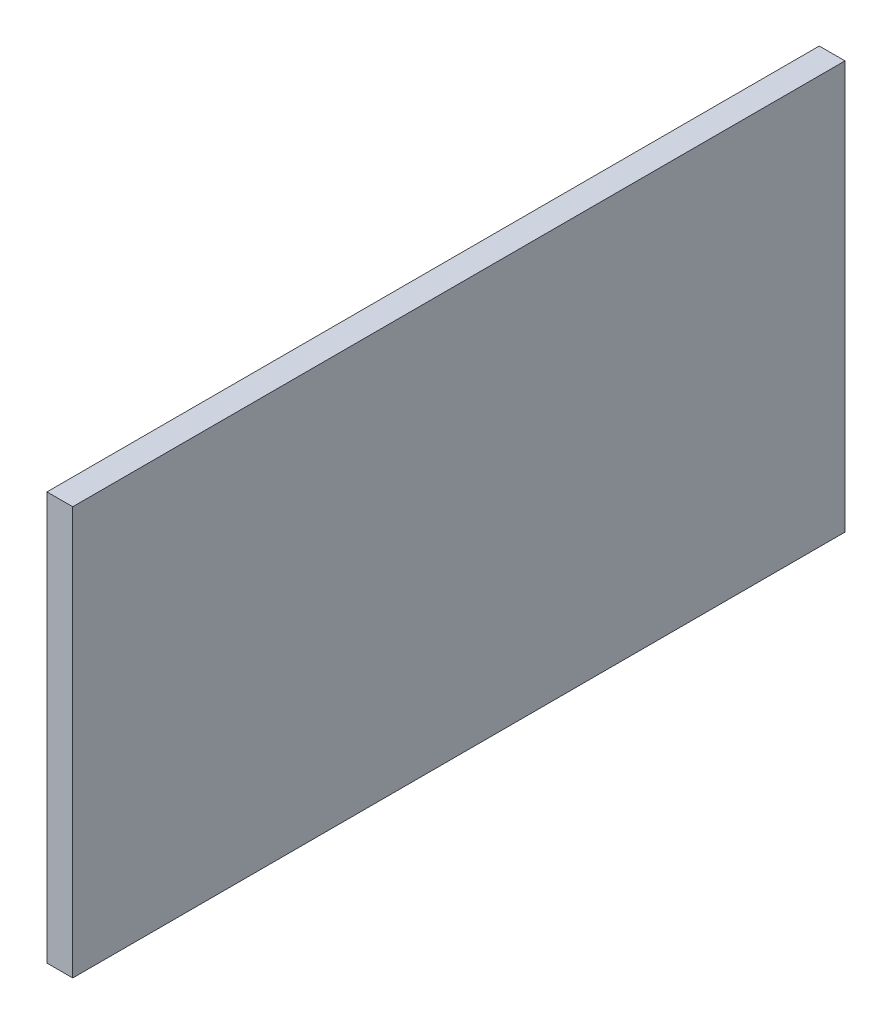
ISO-10303-21;
HEADER;
FILE_DESCRIPTION(('STEP AP214'),'2;1');
FILE_NAME('part.step','',(''),(''),'','','');
FILE_SCHEMA(('AUTOMOTIVE_DESIGN { 1 0 10303 214 1 1 1 1 }'));
ENDSEC;
DATA;
#1=APPLICATION_CONTEXT('core data for automotive mechanical design processes');
#2=APPLICATION_PROTOCOL_DEFINITION('international standard','automotive_design',2000,#1);
#3=PRODUCT_CONTEXT('',#1,'mechanical');
#4=PRODUCT('Part','Part','',(#3));
#5=PRODUCT_RELATED_PRODUCT_CATEGORY('part','',(#4));
#6=PRODUCT_DEFINITION_FORMATION('','',#4);
#7=PRODUCT_DEFINITION_CONTEXT('part definition',#1,'design');
#8=PRODUCT_DEFINITION('design','',#6,#7);
#9=PRODUCT_DEFINITION_SHAPE('','',#8);
#10=(LENGTH_UNIT() NAMED_UNIT(*) SI_UNIT(.MILLI.,.METRE.));
#11=(NAMED_UNIT(*) PLANE_ANGLE_UNIT() SI_UNIT($,.RADIAN.));
#12=(NAMED_UNIT(*) SI_UNIT($,.STERADIAN.) SOLID_ANGLE_UNIT());
#13=UNCERTAINTY_MEASURE_WITH_UNIT(LENGTH_MEASURE(1.E-05),#10,'distance_accuracy_value','');
#14=(GEOMETRIC_REPRESENTATION_CONTEXT(3) GLOBAL_UNCERTAINTY_ASSIGNED_CONTEXT((#13)) GLOBAL_UNIT_ASSIGNED_CONTEXT((#10,
#11,#12)) REPRESENTATION_CONTEXT('',''));
#15=CARTESIAN_POINT('',(0.,0.,0.));
#16=DIRECTION('',(0.,0.,1.));
#17=DIRECTION('',(1.,0.,0.));
#18=AXIS2_PLACEMENT_3D('',#15,#16,#17);
#19=CARTESIAN_POINT('',(12.5,99.085,-187.5));
#20=DIRECTION('',(0.,0.,1.));
#21=DIRECTION('',(0.,-1.,0.));
#22=AXIS2_PLACEMENT_3D('',#19,#20,#21);
#23=PLANE('',#22);
#24=DIRECTION('',(0.,1.,0.));
#25=VECTOR('',#24,1.);
#26=CARTESIAN_POINT('',(0.,99.085,-187.5));
#27=LINE('',#26,#25);
#28=CARTESIAN_POINT('',(0.,-99.085,-187.5));
#29=VERTEX_POINT('',#28);
#30=CARTESIAN_POINT('',(0.,99.085,-187.5));
#31=VERTEX_POINT('',#30);
#32=EDGE_CURVE('E109',#29,#31,#27,.T.);
#33=ORIENTED_EDGE('',*,*,#32,.T.);
#34=DIRECTION('',(-1.,0.,0.));
#35=VECTOR('',#34,1.);
#36=CARTESIAN_POINT('',(12.5,99.085,-187.5));
#37=LINE('',#36,#35);
#38=CARTESIAN_POINT('',(12.5,99.085,-187.5));
#39=VERTEX_POINT('',#38);
#40=EDGE_CURVE('E11',#39,#31,#37,.T.);
#41=ORIENTED_EDGE('',*,*,#40,.F.);
#42=DIRECTION('',(0.,1.,0.));
#43=VECTOR('',#42,1.);
#44=CARTESIAN_POINT('',(12.5,99.085,-187.5));
#45=LINE('',#44,#43);
#46=CARTESIAN_POINT('',(12.5,-99.085,-187.5));
#47=VERTEX_POINT('',#46);
#48=EDGE_CURVE('E93',#47,#39,#45,.T.);
#49=ORIENTED_EDGE('',*,*,#48,.F.);
#50=DIRECTION('',(-1.,0.,0.));
#51=VECTOR('',#50,1.);
#52=CARTESIAN_POINT('',(12.5,-99.085,-187.5));
#53=LINE('',#52,#51);
#54=EDGE_CURVE('E105',#47,#29,#53,.T.);
#55=ORIENTED_EDGE('',*,*,#54,.T.);
#56=EDGE_LOOP('',(#33,#41,#49,#55));
#57=FACE_BOUND('',#56,.T.);
#58=ADVANCED_FACE('F41',(#57),#23,.F.);
#59=CARTESIAN_POINT('',(12.5,99.085,187.5));
#60=DIRECTION('',(0.,-1.,0.));
#61=DIRECTION('',(0.,0.,-1.));
#62=AXIS2_PLACEMENT_3D('',#59,#60,#61);
#63=PLANE('',#62);
#64=DIRECTION('',(0.,0.,1.));
#65=VECTOR('',#64,1.);
#66=CARTESIAN_POINT('',(0.,99.085,187.5));
#67=LINE('',#66,#65);
#68=CARTESIAN_POINT('',(0.,99.085,187.5));
#69=VERTEX_POINT('',#68);
#70=EDGE_CURVE('E98',#31,#69,#67,.T.);
#71=ORIENTED_EDGE('',*,*,#70,.T.);
#72=DIRECTION('',(-1.,0.,0.));
#73=VECTOR('',#72,1.);
#74=CARTESIAN_POINT('',(12.5,99.085,187.5));
#75=LINE('',#74,#73);
#76=CARTESIAN_POINT('',(12.5,99.085,187.5));
#77=VERTEX_POINT('',#76);
#78=EDGE_CURVE('E50',#77,#69,#75,.T.);
#79=ORIENTED_EDGE('',*,*,#78,.F.);
#80=DIRECTION('',(0.,0.,1.));
#81=VECTOR('',#80,1.);
#82=CARTESIAN_POINT('',(12.5,99.085,187.5));
#83=LINE('',#82,#81);
#84=EDGE_CURVE('E88',#39,#77,#83,.T.);
#85=ORIENTED_EDGE('',*,*,#84,.F.);
#86=ORIENTED_EDGE('',*,*,#40,.T.);
#87=EDGE_LOOP('',(#71,#79,#85,#86));
#88=FACE_BOUND('',#87,.T.);
#89=ADVANCED_FACE('F97',(#88),#63,.F.);
#90=CARTESIAN_POINT('',(12.5,99.085,187.5));
#91=DIRECTION('',(0.,0.,-1.));
#92=DIRECTION('',(0.,1.,0.));
#93=AXIS2_PLACEMENT_3D('',#90,#91,#92);
#94=PLANE('',#93);
#95=DIRECTION('',(0.,-1.,0.));
#96=VECTOR('',#95,1.);
#97=CARTESIAN_POINT('',(0.,99.085,187.5));
#98=LINE('',#97,#96);
#99=CARTESIAN_POINT('',(0.,-99.085,187.5));
#100=VERTEX_POINT('',#99);
#101=EDGE_CURVE('E75',#69,#100,#98,.T.);
#102=ORIENTED_EDGE('',*,*,#101,.T.);
#103=DIRECTION('',(-1.,0.,0.));
#104=VECTOR('',#103,1.);
#105=CARTESIAN_POINT('',(12.5,-99.085,187.5));
#106=LINE('',#105,#104);
#107=CARTESIAN_POINT('',(12.5,-99.085,187.5));
#108=VERTEX_POINT('',#107);
#109=EDGE_CURVE('E100',#108,#100,#106,.T.);
#110=ORIENTED_EDGE('',*,*,#109,.F.);
#111=DIRECTION('',(0.,-1.,0.));
#112=VECTOR('',#111,1.);
#113=CARTESIAN_POINT('',(12.5,99.085,187.5));
#114=LINE('',#113,#112);
#115=EDGE_CURVE('E91',#77,#108,#114,.T.);
#116=ORIENTED_EDGE('',*,*,#115,.F.);
#117=ORIENTED_EDGE('',*,*,#78,.T.);
#118=EDGE_LOOP('',(#102,#110,#116,#117));
#119=FACE_BOUND('',#118,.T.);
#120=ADVANCED_FACE('F101',(#119),#94,.F.);
#121=CARTESIAN_POINT('',(12.5,-99.085,187.5));
#122=DIRECTION('',(0.,1.,0.));
#123=DIRECTION('',(0.,0.,1.));
#124=AXIS2_PLACEMENT_3D('',#121,#122,#123);
#125=PLANE('',#124);
#126=DIRECTION('',(0.,0.,-1.));
#127=VECTOR('',#126,1.);
#128=CARTESIAN_POINT('',(0.,-99.085,187.5));
#129=LINE('',#128,#127);
#130=EDGE_CURVE('E81',#100,#29,#129,.T.);
#131=ORIENTED_EDGE('',*,*,#130,.T.);
#132=ORIENTED_EDGE('',*,*,#54,.F.);
#133=DIRECTION('',(0.,0.,-1.));
#134=VECTOR('',#133,1.);
#135=CARTESIAN_POINT('',(12.5,-99.085,187.5));
#136=LINE('',#135,#134);
#137=EDGE_CURVE('E58',#108,#47,#136,.T.);
#138=ORIENTED_EDGE('',*,*,#137,.F.);
#139=ORIENTED_EDGE('',*,*,#109,.T.);
#140=EDGE_LOOP('',(#131,#132,#138,#139));
#141=FACE_BOUND('',#140,.T.);
#142=ADVANCED_FACE('F122',(#141),#125,.F.);
#143=CARTESIAN_POINT('',(12.5,0.,0.));
#144=DIRECTION('',(1.,0.,0.));
#145=DIRECTION('',(0.,0.,-1.));
#146=AXIS2_PLACEMENT_3D('',#143,#144,#145);
#147=PLANE('',#146);
#148=ORIENTED_EDGE('',*,*,#48,.T.);
#149=ORIENTED_EDGE('',*,*,#84,.T.);
#150=ORIENTED_EDGE('',*,*,#115,.T.);
#151=ORIENTED_EDGE('',*,*,#137,.T.);
#152=EDGE_LOOP('',(#148,#149,#150,#151));
#153=FACE_BOUND('',#152,.T.);
#154=ADVANCED_FACE('F89',(#153),#147,.T.);
#155=CARTESIAN_POINT('',(0.,0.,0.));
#156=DIRECTION('',(1.,0.,0.));
#157=DIRECTION('',(0.,0.,-1.));
#158=AXIS2_PLACEMENT_3D('',#155,#156,#157);
#159=PLANE('',#158);
#160=ORIENTED_EDGE('',*,*,#32,.F.);
#161=ORIENTED_EDGE('',*,*,#130,.F.);
#162=ORIENTED_EDGE('',*,*,#101,.F.);
#163=ORIENTED_EDGE('',*,*,#70,.F.);
#164=EDGE_LOOP('',(#160,#161,#162,#163));
#165=FACE_BOUND('',#164,.T.);
#166=ADVANCED_FACE('F125',(#165),#159,.F.);
#167=CLOSED_SHELL('',(#58,#89,#120,#142,#154,#166));
#168=MANIFOLD_SOLID_BREP('B2',#167);
#169=ADVANCED_BREP_SHAPE_REPRESENTATION('',(#18,#168),#14);
#170=SHAPE_DEFINITION_REPRESENTATION(#9,#169);
ENDSEC;
END-ISO-10303-21;
